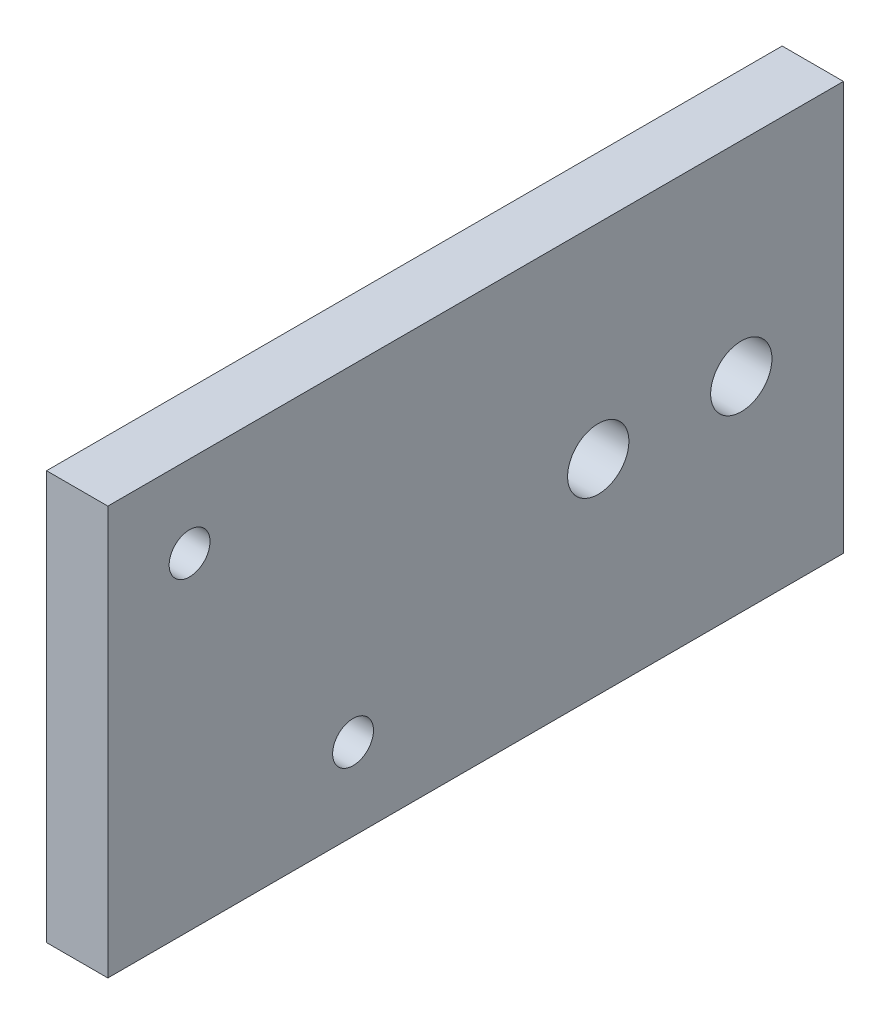
ISO-10303-21;
HEADER;
FILE_DESCRIPTION(('STEP AP214'),'2;1');
FILE_NAME('part.step','',(''),(''),'','','');
FILE_SCHEMA(('AUTOMOTIVE_DESIGN { 1 0 10303 214 1 1 1 1 }'));
ENDSEC;
DATA;
#1=APPLICATION_CONTEXT('core data for automotive mechanical design processes');
#2=APPLICATION_PROTOCOL_DEFINITION('international standard','automotive_design',2000,#1);
#3=PRODUCT_CONTEXT('',#1,'mechanical');
#4=PRODUCT('Part','Part','',(#3));
#5=PRODUCT_RELATED_PRODUCT_CATEGORY('part','',(#4));
#6=PRODUCT_DEFINITION_FORMATION('','',#4);
#7=PRODUCT_DEFINITION_CONTEXT('part definition',#1,'design');
#8=PRODUCT_DEFINITION('design','',#6,#7);
#9=PRODUCT_DEFINITION_SHAPE('','',#8);
#10=(LENGTH_UNIT() NAMED_UNIT(*) SI_UNIT(.MILLI.,.METRE.));
#11=(NAMED_UNIT(*) PLANE_ANGLE_UNIT() SI_UNIT($,.RADIAN.));
#12=(NAMED_UNIT(*) SI_UNIT($,.STERADIAN.) SOLID_ANGLE_UNIT());
#13=UNCERTAINTY_MEASURE_WITH_UNIT(LENGTH_MEASURE(1.E-05),#10,'distance_accuracy_value','');
#14=(GEOMETRIC_REPRESENTATION_CONTEXT(3) GLOBAL_UNCERTAINTY_ASSIGNED_CONTEXT((#13)) GLOBAL_UNIT_ASSIGNED_CONTEXT((#10,
#11,#12)) REPRESENTATION_CONTEXT('',''));
#15=CARTESIAN_POINT('',(0.,0.,0.));
#16=DIRECTION('',(0.,0.,1.));
#17=DIRECTION('',(1.,0.,0.));
#18=AXIS2_PLACEMENT_3D('',#15,#16,#17);
#19=CARTESIAN_POINT('',(3.,-10.,0.));
#20=DIRECTION('',(0.,1.,0.));
#21=DIRECTION('',(0.,0.,1.));
#22=AXIS2_PLACEMENT_3D('',#19,#20,#21);
#23=PLANE('',#22);
#24=DIRECTION('',(0.,0.,-1.));
#25=VECTOR('',#24,1.);
#26=CARTESIAN_POINT('',(0.,-10.,0.));
#27=LINE('',#26,#25);
#28=CARTESIAN_POINT('',(0.,-10.,18.));
#29=VERTEX_POINT('',#28);
#30=CARTESIAN_POINT('',(0.,-10.,-18.));
#31=VERTEX_POINT('',#30);
#32=EDGE_CURVE('E108',#29,#31,#27,.T.);
#33=ORIENTED_EDGE('',*,*,#32,.T.);
#34=DIRECTION('',(-1.,0.,0.));
#35=VECTOR('',#34,1.);
#36=CARTESIAN_POINT('',(3.,-10.,-18.));
#37=LINE('',#36,#35);
#38=CARTESIAN_POINT('',(3.,-10.,-18.));
#39=VERTEX_POINT('',#38);
#40=EDGE_CURVE('E11',#39,#31,#37,.T.);
#41=ORIENTED_EDGE('',*,*,#40,.F.);
#42=DIRECTION('',(0.,0.,-1.));
#43=VECTOR('',#42,1.);
#44=CARTESIAN_POINT('',(3.,-10.,0.));
#45=LINE('',#44,#43);
#46=CARTESIAN_POINT('',(3.,-10.,18.));
#47=VERTEX_POINT('',#46);
#48=EDGE_CURVE('E87',#47,#39,#45,.T.);
#49=ORIENTED_EDGE('',*,*,#48,.F.);
#50=DIRECTION('',(-1.,0.,0.));
#51=VECTOR('',#50,1.);
#52=CARTESIAN_POINT('',(3.,-10.,18.));
#53=LINE('',#52,#51);
#54=EDGE_CURVE('E53',#47,#29,#53,.T.);
#55=ORIENTED_EDGE('',*,*,#54,.T.);
#56=EDGE_LOOP('',(#33,#41,#49,#55));
#57=FACE_BOUND('',#56,.T.);
#58=ADVANCED_FACE('F35',(#57),#23,.F.);
#59=CARTESIAN_POINT('',(3.,0.,-18.));
#60=DIRECTION('',(0.,0.,1.));
#61=DIRECTION('',(0.,-1.,0.));
#62=AXIS2_PLACEMENT_3D('',#59,#60,#61);
#63=PLANE('',#62);
#64=DIRECTION('',(0.,1.,0.));
#65=VECTOR('',#64,1.);
#66=CARTESIAN_POINT('',(0.,0.,-18.));
#67=LINE('',#66,#65);
#68=CARTESIAN_POINT('',(0.,9.99999999999999,-18.));
#69=VERTEX_POINT('',#68);
#70=EDGE_CURVE('E92',#31,#69,#67,.T.);
#71=ORIENTED_EDGE('',*,*,#70,.T.);
#72=DIRECTION('',(-1.,0.,0.));
#73=VECTOR('',#72,1.);
#74=CARTESIAN_POINT('',(3.,9.99999999999999,-18.));
#75=LINE('',#74,#73);
#76=CARTESIAN_POINT('',(3.,9.99999999999999,-18.));
#77=VERTEX_POINT('',#76);
#78=EDGE_CURVE('E44',#77,#69,#75,.T.);
#79=ORIENTED_EDGE('',*,*,#78,.F.);
#80=DIRECTION('',(0.,1.,0.));
#81=VECTOR('',#80,1.);
#82=CARTESIAN_POINT('',(3.,0.,-18.));
#83=LINE('',#82,#81);
#84=EDGE_CURVE('E78',#39,#77,#83,.T.);
#85=ORIENTED_EDGE('',*,*,#84,.F.);
#86=ORIENTED_EDGE('',*,*,#40,.T.);
#87=EDGE_LOOP('',(#71,#79,#85,#86));
#88=FACE_BOUND('',#87,.T.);
#89=ADVANCED_FACE('F91',(#88),#63,.F.);
#90=CARTESIAN_POINT('',(3.,9.99999999999999,0.));
#91=DIRECTION('',(0.,1.,0.));
#92=DIRECTION('',(0.,0.,1.));
#93=AXIS2_PLACEMENT_3D('',#90,#91,#92);
#94=PLANE('',#93);
#95=DIRECTION('',(0.,0.,-1.));
#96=VECTOR('',#95,1.);
#97=CARTESIAN_POINT('',(0.,9.99999999999999,0.));
#98=LINE('',#97,#96);
#99=CARTESIAN_POINT('',(0.,9.99999999999999,18.));
#100=VERTEX_POINT('',#99);
#101=EDGE_CURVE('E111',#100,#69,#98,.T.);
#102=ORIENTED_EDGE('',*,*,#101,.F.);
#103=DIRECTION('',(-1.,0.,0.));
#104=VECTOR('',#103,1.);
#105=CARTESIAN_POINT('',(3.,9.99999999999999,18.));
#106=LINE('',#105,#104);
#107=CARTESIAN_POINT('',(3.,9.99999999999999,18.));
#108=VERTEX_POINT('',#107);
#109=EDGE_CURVE('E67',#108,#100,#106,.T.);
#110=ORIENTED_EDGE('',*,*,#109,.F.);
#111=DIRECTION('',(0.,0.,-1.));
#112=VECTOR('',#111,1.);
#113=CARTESIAN_POINT('',(3.,9.99999999999999,0.));
#114=LINE('',#113,#112);
#115=EDGE_CURVE('E86',#108,#77,#114,.T.);
#116=ORIENTED_EDGE('',*,*,#115,.T.);
#117=ORIENTED_EDGE('',*,*,#78,.T.);
#118=EDGE_LOOP('',(#102,#110,#116,#117));
#119=FACE_BOUND('',#118,.T.);
#120=ADVANCED_FACE('F96',(#119),#94,.T.);
#121=CARTESIAN_POINT('',(3.,0.,-6.));
#122=DIRECTION('',(-1.,0.,0.));
#123=DIRECTION('',(0.,0.,1.));
#124=AXIS2_PLACEMENT_3D('',#121,#122,#123);
#125=CYLINDRICAL_SURFACE('',#124,1.5);
#126=CARTESIAN_POINT('',(3.,0.,-6.));
#127=DIRECTION('',(1.,0.,0.));
#128=DIRECTION('',(0.,0.,-1.));
#129=AXIS2_PLACEMENT_3D('',#126,#127,#128);
#130=CIRCLE('',#129,1.5);
#131=CARTESIAN_POINT('',(3.,0.,-7.5));
#132=VERTEX_POINT('',#131);
#133=EDGE_CURVE('E99',#132,#132,#130,.T.);
#134=ORIENTED_EDGE('',*,*,#133,.T.);
#135=EDGE_LOOP('',(#134));
#136=FACE_BOUND('',#135,.T.);
#137=CARTESIAN_POINT('',(0.,0.,-6.));
#138=DIRECTION('',(1.,0.,0.));
#139=DIRECTION('',(0.,0.,-1.));
#140=AXIS2_PLACEMENT_3D('',#137,#138,#139);
#141=CIRCLE('',#140,1.5);
#142=CARTESIAN_POINT('',(0.,0.,-7.5));
#143=VERTEX_POINT('',#142);
#144=EDGE_CURVE('E116',#143,#143,#141,.T.);
#145=ORIENTED_EDGE('',*,*,#144,.F.);
#146=EDGE_LOOP('',(#145));
#147=FACE_BOUND('',#146,.T.);
#148=ADVANCED_FACE('F164',(#136,#147),#125,.F.);
#149=CARTESIAN_POINT('',(3.,0.,18.));
#150=DIRECTION('',(0.,0.,1.));
#151=DIRECTION('',(0.,-1.,0.));
#152=AXIS2_PLACEMENT_3D('',#149,#150,#151);
#153=PLANE('',#152);
#154=DIRECTION('',(0.,1.,0.));
#155=VECTOR('',#154,1.);
#156=CARTESIAN_POINT('',(0.,0.,18.));
#157=LINE('',#156,#155);
#158=EDGE_CURVE('E113',#29,#100,#157,.T.);
#159=ORIENTED_EDGE('',*,*,#158,.F.);
#160=ORIENTED_EDGE('',*,*,#54,.F.);
#161=DIRECTION('',(0.,1.,0.));
#162=VECTOR('',#161,1.);
#163=CARTESIAN_POINT('',(3.,0.,18.));
#164=LINE('',#163,#162);
#165=EDGE_CURVE('E97',#47,#108,#164,.T.);
#166=ORIENTED_EDGE('',*,*,#165,.T.);
#167=ORIENTED_EDGE('',*,*,#109,.T.);
#168=EDGE_LOOP('',(#159,#160,#166,#167));
#169=FACE_BOUND('',#168,.T.);
#170=ADVANCED_FACE('F153',(#169),#153,.T.);
#171=CARTESIAN_POINT('',(3.,0.,-13.));
#172=DIRECTION('',(-1.,0.,0.));
#173=DIRECTION('',(0.,0.,1.));
#174=AXIS2_PLACEMENT_3D('',#171,#172,#173);
#175=CYLINDRICAL_SURFACE('',#174,1.5);
#176=CARTESIAN_POINT('',(3.,0.,-13.));
#177=DIRECTION('',(1.,0.,0.));
#178=DIRECTION('',(0.,0.,-1.));
#179=AXIS2_PLACEMENT_3D('',#176,#177,#178);
#180=CIRCLE('',#179,1.5);
#181=CARTESIAN_POINT('',(3.,0.,-14.5));
#182=VERTEX_POINT('',#181);
#183=EDGE_CURVE('E105',#182,#182,#180,.T.);
#184=ORIENTED_EDGE('',*,*,#183,.T.);
#185=EDGE_LOOP('',(#184));
#186=FACE_BOUND('',#185,.T.);
#187=CARTESIAN_POINT('',(0.,0.,-13.));
#188=DIRECTION('',(1.,0.,0.));
#189=DIRECTION('',(0.,0.,-1.));
#190=AXIS2_PLACEMENT_3D('',#187,#188,#189);
#191=CIRCLE('',#190,1.5);
#192=CARTESIAN_POINT('',(0.,0.,-14.5));
#193=VERTEX_POINT('',#192);
#194=EDGE_CURVE('E119',#193,#193,#191,.T.);
#195=ORIENTED_EDGE('',*,*,#194,.F.);
#196=EDGE_LOOP('',(#195));
#197=FACE_BOUND('',#196,.T.);
#198=ADVANCED_FACE('F143',(#186,#197),#175,.F.);
#199=CARTESIAN_POINT('',(3.,0.,0.));
#200=DIRECTION('',(1.,0.,0.));
#201=DIRECTION('',(0.,0.,-1.));
#202=AXIS2_PLACEMENT_3D('',#199,#200,#201);
#203=PLANE('',#202);
#204=CARTESIAN_POINT('',(3.,5.99999999999999,14.));
#205=DIRECTION('',(1.,0.,0.));
#206=DIRECTION('',(0.,0.,-1.));
#207=AXIS2_PLACEMENT_3D('',#204,#205,#206);
#208=CIRCLE('',#207,1.);
#209=CARTESIAN_POINT('',(3.,5.99999999999999,13.));
#210=VERTEX_POINT('',#209);
#211=EDGE_CURVE('E125',#210,#210,#208,.T.);
#212=ORIENTED_EDGE('',*,*,#211,.F.);
#213=EDGE_LOOP('',(#212));
#214=FACE_BOUND('',#213,.T.);
#215=CARTESIAN_POINT('',(3.,-6.00000000000001,6.));
#216=DIRECTION('',(1.,0.,0.));
#217=DIRECTION('',(0.,0.,-1.));
#218=AXIS2_PLACEMENT_3D('',#215,#216,#217);
#219=CIRCLE('',#218,1.);
#220=CARTESIAN_POINT('',(3.,-6.00000000000001,5.));
#221=VERTEX_POINT('',#220);
#222=EDGE_CURVE('E130',#221,#221,#219,.T.);
#223=ORIENTED_EDGE('',*,*,#222,.F.);
#224=EDGE_LOOP('',(#223));
#225=FACE_BOUND('',#224,.T.);
#226=ORIENTED_EDGE('',*,*,#48,.T.);
#227=ORIENTED_EDGE('',*,*,#84,.T.);
#228=ORIENTED_EDGE('',*,*,#115,.F.);
#229=ORIENTED_EDGE('',*,*,#165,.F.);
#230=EDGE_LOOP('',(#226,#227,#228,#229));
#231=FACE_BOUND('',#230,.T.);
#232=ORIENTED_EDGE('',*,*,#133,.F.);
#233=EDGE_LOOP('',(#232));
#234=FACE_BOUND('',#233,.T.);
#235=ORIENTED_EDGE('',*,*,#183,.F.);
#236=EDGE_LOOP('',(#235));
#237=FACE_BOUND('',#236,.T.);
#238=ADVANCED_FACE('F82',(#214,#225,#231,#234,#237),#203,.T.);
#239=CARTESIAN_POINT('',(0.,0.,0.));
#240=DIRECTION('',(1.,0.,0.));
#241=DIRECTION('',(0.,0.,-1.));
#242=AXIS2_PLACEMENT_3D('',#239,#240,#241);
#243=PLANE('',#242);
#244=CARTESIAN_POINT('',(0.,5.99999999999999,14.));
#245=DIRECTION('',(1.,0.,0.));
#246=DIRECTION('',(0.,0.,-1.));
#247=AXIS2_PLACEMENT_3D('',#244,#245,#246);
#248=CIRCLE('',#247,1.);
#249=CARTESIAN_POINT('',(0.,5.99999999999999,13.));
#250=VERTEX_POINT('',#249);
#251=EDGE_CURVE('E38',#250,#250,#248,.T.);
#252=ORIENTED_EDGE('',*,*,#251,.T.);
#253=EDGE_LOOP('',(#252));
#254=FACE_BOUND('',#253,.T.);
#255=CARTESIAN_POINT('',(0.,-6.00000000000001,6.));
#256=DIRECTION('',(1.,0.,0.));
#257=DIRECTION('',(0.,0.,-1.));
#258=AXIS2_PLACEMENT_3D('',#255,#256,#257);
#259=CIRCLE('',#258,1.);
#260=CARTESIAN_POINT('',(0.,-6.00000000000001,5.));
#261=VERTEX_POINT('',#260);
#262=EDGE_CURVE('E123',#261,#261,#259,.T.);
#263=ORIENTED_EDGE('',*,*,#262,.T.);
#264=EDGE_LOOP('',(#263));
#265=FACE_BOUND('',#264,.T.);
#266=ORIENTED_EDGE('',*,*,#32,.F.);
#267=ORIENTED_EDGE('',*,*,#158,.T.);
#268=ORIENTED_EDGE('',*,*,#101,.T.);
#269=ORIENTED_EDGE('',*,*,#70,.F.);
#270=EDGE_LOOP('',(#266,#267,#268,#269));
#271=FACE_BOUND('',#270,.T.);
#272=ORIENTED_EDGE('',*,*,#144,.T.);
#273=EDGE_LOOP('',(#272));
#274=FACE_BOUND('',#273,.T.);
#275=ORIENTED_EDGE('',*,*,#194,.T.);
#276=EDGE_LOOP('',(#275));
#277=FACE_BOUND('',#276,.T.);
#278=ADVANCED_FACE('F142',(#254,#265,#271,#274,#277),#243,.F.);
#279=CARTESIAN_POINT('',(-7.,-6.00000000000001,6.));
#280=DIRECTION('',(1.,0.,0.));
#281=DIRECTION('',(0.,0.,-1.));
#282=AXIS2_PLACEMENT_3D('',#279,#280,#281);
#283=CYLINDRICAL_SURFACE('',#282,1.);
#284=ORIENTED_EDGE('',*,*,#222,.T.);
#285=EDGE_LOOP('',(#284));
#286=FACE_BOUND('',#285,.T.);
#287=ORIENTED_EDGE('',*,*,#262,.F.);
#288=EDGE_LOOP('',(#287));
#289=FACE_BOUND('',#288,.T.);
#290=ADVANCED_FACE('F138',(#286,#289),#283,.F.);
#291=CARTESIAN_POINT('',(-7.,5.99999999999999,14.));
#292=DIRECTION('',(1.,0.,0.));
#293=DIRECTION('',(0.,0.,-1.));
#294=AXIS2_PLACEMENT_3D('',#291,#292,#293);
#295=CYLINDRICAL_SURFACE('',#294,1.);
#296=ORIENTED_EDGE('',*,*,#211,.T.);
#297=EDGE_LOOP('',(#296));
#298=FACE_BOUND('',#297,.T.);
#299=ORIENTED_EDGE('',*,*,#251,.F.);
#300=EDGE_LOOP('',(#299));
#301=FACE_BOUND('',#300,.T.);
#302=ADVANCED_FACE('F213',(#298,#301),#295,.F.);
#303=CLOSED_SHELL('',(#58,#89,#120,#148,#170,#198,#238,#278,#290,#302));
#304=MANIFOLD_SOLID_BREP('B2',#303);
#305=ADVANCED_BREP_SHAPE_REPRESENTATION('',(#18,#304),#14);
#306=SHAPE_DEFINITION_REPRESENTATION(#9,#305);
ENDSEC;
END-ISO-10303-21;
